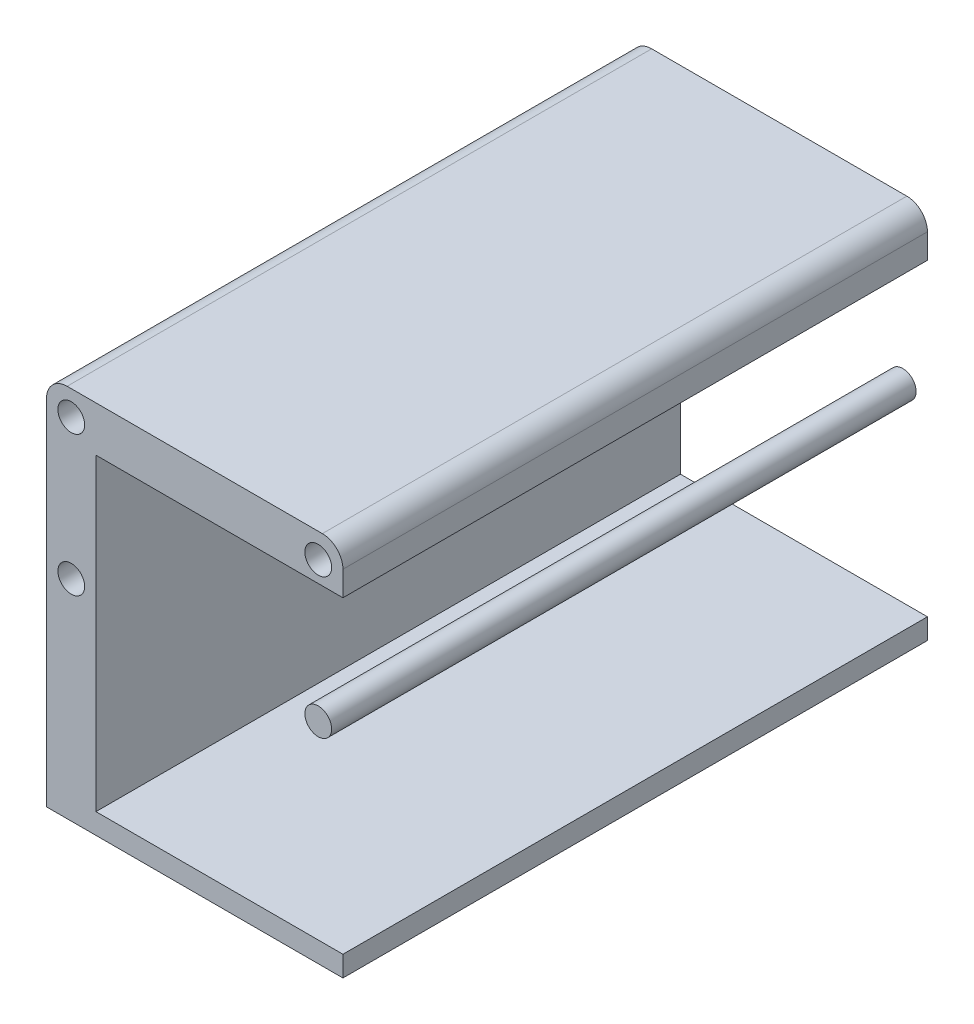
ISO-10303-21;
HEADER;
FILE_DESCRIPTION(('STEP AP214'),'2;1');
FILE_NAME('part.step','',(''),(''),'','','');
FILE_SCHEMA(('AUTOMOTIVE_DESIGN { 1 0 10303 214 1 1 1 1 }'));
ENDSEC;
DATA;
#1=APPLICATION_CONTEXT('core data for automotive mechanical design processes');
#2=APPLICATION_PROTOCOL_DEFINITION('international standard','automotive_design',2000,#1);
#3=PRODUCT_CONTEXT('',#1,'mechanical');
#4=PRODUCT('Part','Part','',(#3));
#5=PRODUCT_RELATED_PRODUCT_CATEGORY('part','',(#4));
#6=PRODUCT_DEFINITION_FORMATION('','',#4);
#7=PRODUCT_DEFINITION_CONTEXT('part definition',#1,'design');
#8=PRODUCT_DEFINITION('design','',#6,#7);
#9=PRODUCT_DEFINITION_SHAPE('','',#8);
#10=(LENGTH_UNIT() NAMED_UNIT(*) SI_UNIT(.MILLI.,.METRE.));
#11=(NAMED_UNIT(*) PLANE_ANGLE_UNIT() SI_UNIT($,.RADIAN.));
#12=(NAMED_UNIT(*) SI_UNIT($,.STERADIAN.) SOLID_ANGLE_UNIT());
#13=UNCERTAINTY_MEASURE_WITH_UNIT(LENGTH_MEASURE(1.E-05),#10,'distance_accuracy_value','');
#14=(GEOMETRIC_REPRESENTATION_CONTEXT(3) GLOBAL_UNCERTAINTY_ASSIGNED_CONTEXT((#13)) GLOBAL_UNIT_ASSIGNED_CONTEXT((#10,
#11,#12)) REPRESENTATION_CONTEXT('',''));
#15=CARTESIAN_POINT('',(0.,0.,0.));
#16=DIRECTION('',(0.,0.,1.));
#17=DIRECTION('',(1.,0.,0.));
#18=AXIS2_PLACEMENT_3D('',#15,#16,#17);
#19=CARTESIAN_POINT('',(30.0000000000002,51.0000000000004,147.));
#20=DIRECTION('',(0.,0.,-1.));
#21=DIRECTION('',(-1.,0.,0.));
#22=AXIS2_PLACEMENT_3D('',#19,#20,#21);
#23=CYLINDRICAL_SURFACE('',#22,3.25000000000001);
#24=CARTESIAN_POINT('',(30.0000000000002,51.0000000000004,147.));
#25=DIRECTION('',(0.,0.,1.));
#26=DIRECTION('',(1.,0.,0.));
#27=AXIS2_PLACEMENT_3D('',#24,#25,#26);
#28=CIRCLE('',#27,3.25000000000001);
#29=CARTESIAN_POINT('',(33.2500000000003,51.0000000000004,147.));
#30=VERTEX_POINT('',#29);
#31=EDGE_CURVE('E49',#30,#30,#28,.T.);
#32=ORIENTED_EDGE('',*,*,#31,.F.);
#33=EDGE_LOOP('',(#32));
#34=FACE_BOUND('',#33,.T.);
#35=CARTESIAN_POINT('',(30.0000000000002,51.0000000000004,5.));
#36=DIRECTION('',(0.,0.,1.));
#37=DIRECTION('',(1.,0.,0.));
#38=AXIS2_PLACEMENT_3D('',#35,#36,#37);
#39=CIRCLE('',#38,3.25000000000001);
#40=CARTESIAN_POINT('',(33.2500000000003,51.0000000000004,5.));
#41=VERTEX_POINT('',#40);
#42=EDGE_CURVE('E11',#41,#41,#39,.T.);
#43=ORIENTED_EDGE('',*,*,#42,.T.);
#44=EDGE_LOOP('',(#43));
#45=FACE_BOUND('',#44,.T.);
#46=ADVANCED_FACE('F45',(#34,#45),#23,.T.);
#47=CARTESIAN_POINT('',(30.0000000000002,51.0000000000004,147.));
#48=DIRECTION('',(0.,0.,1.));
#49=DIRECTION('',(1.,0.,0.));
#50=AXIS2_PLACEMENT_3D('',#47,#48,#49);
#51=PLANE('',#50);
#52=ORIENTED_EDGE('',*,*,#31,.T.);
#53=EDGE_LOOP('',(#52));
#54=FACE_BOUND('',#53,.T.);
#55=ADVANCED_FACE('F47',(#54),#51,.T.);
#56=CARTESIAN_POINT('',(30.0000000000002,51.0000000000004,5.));
#57=DIRECTION('',(0.,0.,1.));
#58=DIRECTION('',(1.,0.,0.));
#59=AXIS2_PLACEMENT_3D('',#56,#57,#58);
#60=PLANE('',#59);
#61=ORIENTED_EDGE('',*,*,#42,.F.);
#62=EDGE_LOOP('',(#61));
#63=FACE_BOUND('',#62,.T.);
#64=ADVANCED_FACE('F64',(#63),#60,.F.);
#65=CLOSED_SHELL('',(#46,#55,#64));
#66=MANIFOLD_SOLID_BREP('B2',#65);
#67=CARTESIAN_POINT('',(-31.0000000000002,85.9999999999999,147.));
#68=DIRECTION('',(0.,0.,1.));
#69=DIRECTION('',(1.,0.,0.));
#70=AXIS2_PLACEMENT_3D('',#67,#68,#69);
#71=PLANE('',#70);
#72=CARTESIAN_POINT('',(-30.0000000000002,51.0000000000004,147.));
#73=DIRECTION('',(0.,0.,1.));
#74=DIRECTION('',(1.,0.,0.));
#75=AXIS2_PLACEMENT_3D('',#72,#73,#74);
#76=CIRCLE('',#75,3.25000000000001);
#77=CARTESIAN_POINT('',(-26.7500000000002,51.0000000000004,147.));
#78=VERTEX_POINT('',#77);
#79=EDGE_CURVE('E271',#78,#78,#76,.T.);
#80=ORIENTED_EDGE('',*,*,#79,.F.);
#81=EDGE_LOOP('',(#80));
#82=FACE_BOUND('',#81,.T.);
#83=CARTESIAN_POINT('',(-31.0000000000002,85.9999999999999,147.));
#84=DIRECTION('',(0.,0.,1.));
#85=DIRECTION('',(1.,0.,0.));
#86=AXIS2_PLACEMENT_3D('',#83,#84,#85);
#87=CIRCLE('',#86,5.00000000000003);
#88=CARTESIAN_POINT('',(-31.0000000000002,91.,147.));
#89=VERTEX_POINT('',#88);
#90=CARTESIAN_POINT('',(-36.0000000000002,85.9999999999999,147.));
#91=VERTEX_POINT('',#90);
#92=EDGE_CURVE('E220',#89,#91,#87,.T.);
#93=ORIENTED_EDGE('',*,*,#92,.T.);
#94=DIRECTION('',(0.,-1.,0.));
#95=VECTOR('',#94,1.);
#96=CARTESIAN_POINT('',(-36.0000000000002,85.9999999999999,147.));
#97=LINE('',#96,#95);
#98=CARTESIAN_POINT('',(-36.0000000000002,0.,147.));
#99=VERTEX_POINT('',#98);
#100=EDGE_CURVE('E158',#91,#99,#97,.T.);
#101=ORIENTED_EDGE('',*,*,#100,.T.);
#102=DIRECTION('',(1.,0.,0.));
#103=VECTOR('',#102,1.);
#104=CARTESIAN_POINT('',(-36.0000000000002,0.,147.));
#105=LINE('',#104,#103);
#106=CARTESIAN_POINT('',(36.0000000000002,0.,147.));
#107=VERTEX_POINT('',#106);
#108=EDGE_CURVE('E241',#99,#107,#105,.T.);
#109=ORIENTED_EDGE('',*,*,#108,.T.);
#110=DIRECTION('',(0.,1.,0.));
#111=VECTOR('',#110,1.);
#112=CARTESIAN_POINT('',(36.0000000000002,5.00000000000001,147.));
#113=LINE('',#112,#111);
#114=CARTESIAN_POINT('',(36.0000000000002,5.00000000000001,147.));
#115=VERTEX_POINT('',#114);
#116=EDGE_CURVE('E260',#107,#115,#113,.T.);
#117=ORIENTED_EDGE('',*,*,#116,.T.);
#118=DIRECTION('',(-1.,0.,0.));
#119=VECTOR('',#118,1.);
#120=CARTESIAN_POINT('',(36.0000000000002,5.00000000000001,147.));
#121=LINE('',#120,#119);
#122=CARTESIAN_POINT('',(-24.,5.00000000000001,147.));
#123=VERTEX_POINT('',#122);
#124=EDGE_CURVE('E257',#115,#123,#121,.T.);
#125=ORIENTED_EDGE('',*,*,#124,.T.);
#126=DIRECTION('',(0.,1.,0.));
#127=VECTOR('',#126,1.);
#128=CARTESIAN_POINT('',(-24.,5.00000000000001,147.));
#129=LINE('',#128,#127);
#130=CARTESIAN_POINT('',(-24.,79.9999999999999,147.));
#131=VERTEX_POINT('',#130);
#132=EDGE_CURVE('E259',#123,#131,#129,.T.);
#133=ORIENTED_EDGE('',*,*,#132,.T.);
#134=DIRECTION('',(1.,0.,0.));
#135=VECTOR('',#134,1.);
#136=CARTESIAN_POINT('',(-24.,79.9999999999999,147.));
#137=LINE('',#136,#135);
#138=CARTESIAN_POINT('',(36.0000000000002,79.9999999999999,147.));
#139=VERTEX_POINT('',#138);
#140=EDGE_CURVE('E183',#131,#139,#137,.T.);
#141=ORIENTED_EDGE('',*,*,#140,.T.);
#142=DIRECTION('',(0.,1.,0.));
#143=VECTOR('',#142,1.);
#144=CARTESIAN_POINT('',(36.0000000000002,79.9999999999999,147.));
#145=LINE('',#144,#143);
#146=CARTESIAN_POINT('',(36.0000000000002,85.9999999999999,147.));
#147=VERTEX_POINT('',#146);
#148=EDGE_CURVE('E177',#139,#147,#145,.T.);
#149=ORIENTED_EDGE('',*,*,#148,.T.);
#150=CARTESIAN_POINT('',(31.0000000000002,85.9999999999999,147.));
#151=DIRECTION('',(0.,0.,1.));
#152=DIRECTION('',(1.,0.,0.));
#153=AXIS2_PLACEMENT_3D('',#150,#151,#152);
#154=CIRCLE('',#153,5.);
#155=CARTESIAN_POINT('',(31.0000000000002,90.9999999999999,147.));
#156=VERTEX_POINT('',#155);
#157=EDGE_CURVE('E181',#147,#156,#154,.T.);
#158=ORIENTED_EDGE('',*,*,#157,.T.);
#159=DIRECTION('',(-1.,0.,0.));
#160=VECTOR('',#159,1.);
#161=CARTESIAN_POINT('',(31.0000000000002,90.9999999999999,147.));
#162=LINE('',#161,#160);
#163=EDGE_CURVE('E109',#156,#89,#162,.T.);
#164=ORIENTED_EDGE('',*,*,#163,.T.);
#165=EDGE_LOOP('',(#93,#101,#109,#117,#125,#133,#141,#149,#158,#164));
#166=FACE_BOUND('',#165,.T.);
#167=CARTESIAN_POINT('',(30.0000000000002,85.0000000000004,147.));
#168=DIRECTION('',(0.,0.,1.));
#169=DIRECTION('',(1.,0.,0.));
#170=AXIS2_PLACEMENT_3D('',#167,#168,#169);
#171=CIRCLE('',#170,3.25);
#172=CARTESIAN_POINT('',(33.2500000000002,85.0000000000004,147.));
#173=VERTEX_POINT('',#172);
#174=EDGE_CURVE('E205',#173,#173,#171,.T.);
#175=ORIENTED_EDGE('',*,*,#174,.F.);
#176=EDGE_LOOP('',(#175));
#177=FACE_BOUND('',#176,.T.);
#178=CARTESIAN_POINT('',(-30.0000000000002,85.0000000000004,147.));
#179=DIRECTION('',(0.,0.,1.));
#180=DIRECTION('',(1.,0.,0.));
#181=AXIS2_PLACEMENT_3D('',#178,#179,#180);
#182=CIRCLE('',#181,3.25000000000001);
#183=CARTESIAN_POINT('',(-26.7500000000002,85.0000000000004,147.));
#184=VERTEX_POINT('',#183);
#185=EDGE_CURVE('E277',#184,#184,#182,.T.);
#186=ORIENTED_EDGE('',*,*,#185,.F.);
#187=EDGE_LOOP('',(#186));
#188=FACE_BOUND('',#187,.T.);
#189=ADVANCED_FACE('F92',(#82,#166,#177,#188),#71,.T.);
#190=CARTESIAN_POINT('',(-31.0000000000002,85.9999999999999,5.));
#191=DIRECTION('',(0.,0.,1.));
#192=DIRECTION('',(1.,0.,0.));
#193=AXIS2_PLACEMENT_3D('',#190,#191,#192);
#194=PLANE('',#193);
#195=CARTESIAN_POINT('',(-31.0000000000002,85.9999999999999,5.));
#196=DIRECTION('',(0.,0.,1.));
#197=DIRECTION('',(1.,0.,0.));
#198=AXIS2_PLACEMENT_3D('',#195,#196,#197);
#199=CIRCLE('',#198,5.00000000000003);
#200=CARTESIAN_POINT('',(-31.0000000000002,91.,5.));
#201=VERTEX_POINT('',#200);
#202=CARTESIAN_POINT('',(-36.0000000000002,85.9999999999999,5.));
#203=VERTEX_POINT('',#202);
#204=EDGE_CURVE('E201',#201,#203,#199,.T.);
#205=ORIENTED_EDGE('',*,*,#204,.F.);
#206=DIRECTION('',(-1.,0.,0.));
#207=VECTOR('',#206,1.);
#208=CARTESIAN_POINT('',(31.0000000000002,90.9999999999999,5.));
#209=LINE('',#208,#207);
#210=CARTESIAN_POINT('',(31.0000000000002,90.9999999999999,5.));
#211=VERTEX_POINT('',#210);
#212=EDGE_CURVE('E150',#211,#201,#209,.T.);
#213=ORIENTED_EDGE('',*,*,#212,.F.);
#214=CARTESIAN_POINT('',(31.0000000000002,85.9999999999999,5.));
#215=DIRECTION('',(0.,0.,1.));
#216=DIRECTION('',(1.,0.,0.));
#217=AXIS2_PLACEMENT_3D('',#214,#215,#216);
#218=CIRCLE('',#217,5.);
#219=CARTESIAN_POINT('',(36.0000000000002,85.9999999999999,5.));
#220=VERTEX_POINT('',#219);
#221=EDGE_CURVE('E144',#220,#211,#218,.T.);
#222=ORIENTED_EDGE('',*,*,#221,.F.);
#223=DIRECTION('',(0.,1.,0.));
#224=VECTOR('',#223,1.);
#225=CARTESIAN_POINT('',(36.0000000000002,79.9999999999999,5.));
#226=LINE('',#225,#224);
#227=CARTESIAN_POINT('',(36.0000000000002,79.9999999999999,5.));
#228=VERTEX_POINT('',#227);
#229=EDGE_CURVE('E191',#228,#220,#226,.T.);
#230=ORIENTED_EDGE('',*,*,#229,.F.);
#231=DIRECTION('',(1.,0.,0.));
#232=VECTOR('',#231,1.);
#233=CARTESIAN_POINT('',(-24.,79.9999999999999,5.));
#234=LINE('',#233,#232);
#235=CARTESIAN_POINT('',(-24.,79.9999999999999,5.));
#236=VERTEX_POINT('',#235);
#237=EDGE_CURVE('E215',#236,#228,#234,.T.);
#238=ORIENTED_EDGE('',*,*,#237,.F.);
#239=DIRECTION('',(0.,1.,0.));
#240=VECTOR('',#239,1.);
#241=CARTESIAN_POINT('',(-24.,5.00000000000001,5.));
#242=LINE('',#241,#240);
#243=CARTESIAN_POINT('',(-24.,5.00000000000001,5.));
#244=VERTEX_POINT('',#243);
#245=EDGE_CURVE('E213',#244,#236,#242,.T.);
#246=ORIENTED_EDGE('',*,*,#245,.F.);
#247=DIRECTION('',(-1.,0.,0.));
#248=VECTOR('',#247,1.);
#249=CARTESIAN_POINT('',(36.0000000000002,5.00000000000001,5.));
#250=LINE('',#249,#248);
#251=CARTESIAN_POINT('',(36.0000000000002,5.00000000000001,5.));
#252=VERTEX_POINT('',#251);
#253=EDGE_CURVE('E211',#252,#244,#250,.T.);
#254=ORIENTED_EDGE('',*,*,#253,.F.);
#255=DIRECTION('',(0.,1.,0.));
#256=VECTOR('',#255,1.);
#257=CARTESIAN_POINT('',(36.0000000000002,5.00000000000001,5.));
#258=LINE('',#257,#256);
#259=CARTESIAN_POINT('',(36.0000000000002,0.,5.));
#260=VERTEX_POINT('',#259);
#261=EDGE_CURVE('E209',#260,#252,#258,.T.);
#262=ORIENTED_EDGE('',*,*,#261,.F.);
#263=DIRECTION('',(1.,0.,0.));
#264=VECTOR('',#263,1.);
#265=CARTESIAN_POINT('',(-36.0000000000002,0.,5.));
#266=LINE('',#265,#264);
#267=CARTESIAN_POINT('',(-36.0000000000002,0.,5.));
#268=VERTEX_POINT('',#267);
#269=EDGE_CURVE('E207',#268,#260,#266,.T.);
#270=ORIENTED_EDGE('',*,*,#269,.F.);
#271=DIRECTION('',(0.,-1.,0.));
#272=VECTOR('',#271,1.);
#273=CARTESIAN_POINT('',(-36.0000000000002,85.9999999999999,5.));
#274=LINE('',#273,#272);
#275=EDGE_CURVE('E204',#203,#268,#274,.T.);
#276=ORIENTED_EDGE('',*,*,#275,.F.);
#277=EDGE_LOOP('',(#205,#213,#222,#230,#238,#246,#254,#262,#270,#276));
#278=FACE_BOUND('',#277,.T.);
#279=CARTESIAN_POINT('',(30.0000000000002,85.0000000000004,5.));
#280=DIRECTION('',(0.,0.,1.));
#281=DIRECTION('',(1.,0.,0.));
#282=AXIS2_PLACEMENT_3D('',#279,#280,#281);
#283=CIRCLE('',#282,3.25);
#284=CARTESIAN_POINT('',(33.2500000000002,85.0000000000004,5.));
#285=VERTEX_POINT('',#284);
#286=EDGE_CURVE('E268',#285,#285,#283,.T.);
#287=ORIENTED_EDGE('',*,*,#286,.T.);
#288=EDGE_LOOP('',(#287));
#289=FACE_BOUND('',#288,.T.);
#290=CARTESIAN_POINT('',(-30.0000000000002,51.0000000000004,5.));
#291=DIRECTION('',(0.,0.,1.));
#292=DIRECTION('',(1.,0.,0.));
#293=AXIS2_PLACEMENT_3D('',#290,#291,#292);
#294=CIRCLE('',#293,3.25000000000001);
#295=CARTESIAN_POINT('',(-26.7500000000002,51.0000000000004,5.));
#296=VERTEX_POINT('',#295);
#297=EDGE_CURVE('E274',#296,#296,#294,.T.);
#298=ORIENTED_EDGE('',*,*,#297,.T.);
#299=EDGE_LOOP('',(#298));
#300=FACE_BOUND('',#299,.T.);
#301=CARTESIAN_POINT('',(-30.0000000000002,85.0000000000004,5.));
#302=DIRECTION('',(0.,0.,1.));
#303=DIRECTION('',(1.,0.,0.));
#304=AXIS2_PLACEMENT_3D('',#301,#302,#303);
#305=CIRCLE('',#304,3.25000000000001);
#306=CARTESIAN_POINT('',(-26.7500000000002,85.0000000000004,5.));
#307=VERTEX_POINT('',#306);
#308=EDGE_CURVE('E280',#307,#307,#305,.T.);
#309=ORIENTED_EDGE('',*,*,#308,.T.);
#310=EDGE_LOOP('',(#309));
#311=FACE_BOUND('',#310,.T.);
#312=ADVANCED_FACE('F245',(#278,#289,#300,#311),#194,.F.);
#313=CARTESIAN_POINT('',(-31.0000000000002,85.9999999999999,147.));
#314=DIRECTION('',(0.,0.,-1.));
#315=DIRECTION('',(-1.,0.,0.));
#316=AXIS2_PLACEMENT_3D('',#313,#314,#315);
#317=CYLINDRICAL_SURFACE('',#316,5.00000000000003);
#318=ORIENTED_EDGE('',*,*,#204,.T.);
#319=DIRECTION('',(0.,0.,-1.));
#320=VECTOR('',#319,1.);
#321=CARTESIAN_POINT('',(-36.0000000000002,85.9999999999999,147.));
#322=LINE('',#321,#320);
#323=EDGE_CURVE('E43',#91,#203,#322,.T.);
#324=ORIENTED_EDGE('',*,*,#323,.F.);
#325=ORIENTED_EDGE('',*,*,#92,.F.);
#326=DIRECTION('',(0.,0.,-1.));
#327=VECTOR('',#326,1.);
#328=CARTESIAN_POINT('',(-31.0000000000002,91.,147.));
#329=LINE('',#328,#327);
#330=EDGE_CURVE('E197',#89,#201,#329,.T.);
#331=ORIENTED_EDGE('',*,*,#330,.T.);
#332=EDGE_LOOP('',(#318,#324,#325,#331));
#333=FACE_BOUND('',#332,.T.);
#334=ADVANCED_FACE('F94',(#333),#317,.T.);
#335=CARTESIAN_POINT('',(-36.0000000000002,85.9999999999999,147.));
#336=DIRECTION('',(1.,0.,0.));
#337=DIRECTION('',(0.,1.,0.));
#338=AXIS2_PLACEMENT_3D('',#335,#336,#337);
#339=PLANE('',#338);
#340=ORIENTED_EDGE('',*,*,#275,.T.);
#341=DIRECTION('',(0.,0.,-1.));
#342=VECTOR('',#341,1.);
#343=CARTESIAN_POINT('',(-36.0000000000002,0.,147.));
#344=LINE('',#343,#342);
#345=EDGE_CURVE('E101',#99,#268,#344,.T.);
#346=ORIENTED_EDGE('',*,*,#345,.F.);
#347=ORIENTED_EDGE('',*,*,#100,.F.);
#348=ORIENTED_EDGE('',*,*,#323,.T.);
#349=EDGE_LOOP('',(#340,#346,#347,#348));
#350=FACE_BOUND('',#349,.T.);
#351=ADVANCED_FACE('F321',(#350),#339,.F.);
#352=CARTESIAN_POINT('',(-36.0000000000002,0.,147.));
#353=DIRECTION('',(0.,1.,0.));
#354=DIRECTION('',(-1.,0.,0.));
#355=AXIS2_PLACEMENT_3D('',#352,#353,#354);
#356=PLANE('',#355);
#357=ORIENTED_EDGE('',*,*,#269,.T.);
#358=DIRECTION('',(0.,0.,-1.));
#359=VECTOR('',#358,1.);
#360=CARTESIAN_POINT('',(36.0000000000002,0.,147.));
#361=LINE('',#360,#359);
#362=EDGE_CURVE('E233',#107,#260,#361,.T.);
#363=ORIENTED_EDGE('',*,*,#362,.F.);
#364=ORIENTED_EDGE('',*,*,#108,.F.);
#365=ORIENTED_EDGE('',*,*,#345,.T.);
#366=EDGE_LOOP('',(#357,#363,#364,#365));
#367=FACE_BOUND('',#366,.T.);
#368=ADVANCED_FACE('F239',(#367),#356,.F.);
#369=CARTESIAN_POINT('',(36.0000000000002,5.00000000000001,147.));
#370=DIRECTION('',(-1.,0.,0.));
#371=DIRECTION('',(0.,-1.,0.));
#372=AXIS2_PLACEMENT_3D('',#369,#370,#371);
#373=PLANE('',#372);
#374=ORIENTED_EDGE('',*,*,#261,.T.);
#375=DIRECTION('',(0.,0.,-1.));
#376=VECTOR('',#375,1.);
#377=CARTESIAN_POINT('',(36.0000000000002,5.00000000000001,147.));
#378=LINE('',#377,#376);
#379=EDGE_CURVE('E230',#115,#252,#378,.T.);
#380=ORIENTED_EDGE('',*,*,#379,.F.);
#381=ORIENTED_EDGE('',*,*,#116,.F.);
#382=ORIENTED_EDGE('',*,*,#362,.T.);
#383=EDGE_LOOP('',(#374,#380,#381,#382));
#384=FACE_BOUND('',#383,.T.);
#385=ADVANCED_FACE('F251',(#384),#373,.F.);
#386=CARTESIAN_POINT('',(36.0000000000002,5.00000000000001,147.));
#387=DIRECTION('',(0.,-1.,0.));
#388=DIRECTION('',(1.,0.,0.));
#389=AXIS2_PLACEMENT_3D('',#386,#387,#388);
#390=PLANE('',#389);
#391=ORIENTED_EDGE('',*,*,#253,.T.);
#392=DIRECTION('',(0.,0.,-1.));
#393=VECTOR('',#392,1.);
#394=CARTESIAN_POINT('',(-24.,5.00000000000001,147.));
#395=LINE('',#394,#393);
#396=EDGE_CURVE('E227',#123,#244,#395,.T.);
#397=ORIENTED_EDGE('',*,*,#396,.F.);
#398=ORIENTED_EDGE('',*,*,#124,.F.);
#399=ORIENTED_EDGE('',*,*,#379,.T.);
#400=EDGE_LOOP('',(#391,#397,#398,#399));
#401=FACE_BOUND('',#400,.T.);
#402=ADVANCED_FACE('F255',(#401),#390,.F.);
#403=CARTESIAN_POINT('',(-24.,5.00000000000001,147.));
#404=DIRECTION('',(-1.,0.,0.));
#405=DIRECTION('',(0.,0.,1.));
#406=AXIS2_PLACEMENT_3D('',#403,#404,#405);
#407=PLANE('',#406);
#408=ORIENTED_EDGE('',*,*,#245,.T.);
#409=DIRECTION('',(0.,0.,-1.));
#410=VECTOR('',#409,1.);
#411=CARTESIAN_POINT('',(-24.,79.9999999999999,147.));
#412=LINE('',#411,#410);
#413=EDGE_CURVE('E224',#131,#236,#412,.T.);
#414=ORIENTED_EDGE('',*,*,#413,.F.);
#415=ORIENTED_EDGE('',*,*,#132,.F.);
#416=ORIENTED_EDGE('',*,*,#396,.T.);
#417=EDGE_LOOP('',(#408,#414,#415,#416));
#418=FACE_BOUND('',#417,.T.);
#419=ADVANCED_FACE('F311',(#418),#407,.F.);
#420=CARTESIAN_POINT('',(-24.,79.9999999999999,147.));
#421=DIRECTION('',(0.,1.,0.));
#422=DIRECTION('',(0.,0.,1.));
#423=AXIS2_PLACEMENT_3D('',#420,#421,#422);
#424=PLANE('',#423);
#425=ORIENTED_EDGE('',*,*,#237,.T.);
#426=DIRECTION('',(0.,0.,-1.));
#427=VECTOR('',#426,1.);
#428=CARTESIAN_POINT('',(36.0000000000002,79.9999999999999,147.));
#429=LINE('',#428,#427);
#430=EDGE_CURVE('E192',#139,#228,#429,.T.);
#431=ORIENTED_EDGE('',*,*,#430,.F.);
#432=ORIENTED_EDGE('',*,*,#140,.F.);
#433=ORIENTED_EDGE('',*,*,#413,.T.);
#434=EDGE_LOOP('',(#425,#431,#432,#433));
#435=FACE_BOUND('',#434,.T.);
#436=ADVANCED_FACE('F308',(#435),#424,.F.);
#437=CARTESIAN_POINT('',(36.0000000000002,79.9999999999999,147.));
#438=DIRECTION('',(-1.,0.,0.));
#439=DIRECTION('',(0.,-1.,0.));
#440=AXIS2_PLACEMENT_3D('',#437,#438,#439);
#441=PLANE('',#440);
#442=ORIENTED_EDGE('',*,*,#229,.T.);
#443=DIRECTION('',(0.,0.,-1.));
#444=VECTOR('',#443,1.);
#445=CARTESIAN_POINT('',(36.0000000000002,85.9999999999999,147.));
#446=LINE('',#445,#444);
#447=EDGE_CURVE('E188',#147,#220,#446,.T.);
#448=ORIENTED_EDGE('',*,*,#447,.F.);
#449=ORIENTED_EDGE('',*,*,#148,.F.);
#450=ORIENTED_EDGE('',*,*,#430,.T.);
#451=EDGE_LOOP('',(#442,#448,#449,#450));
#452=FACE_BOUND('',#451,.T.);
#453=ADVANCED_FACE('F189',(#452),#441,.F.);
#454=CARTESIAN_POINT('',(31.0000000000002,85.9999999999999,147.));
#455=DIRECTION('',(0.,0.,-1.));
#456=DIRECTION('',(-1.,0.,0.));
#457=AXIS2_PLACEMENT_3D('',#454,#455,#456);
#458=CYLINDRICAL_SURFACE('',#457,5.);
#459=ORIENTED_EDGE('',*,*,#221,.T.);
#460=DIRECTION('',(0.,0.,-1.));
#461=VECTOR('',#460,1.);
#462=CARTESIAN_POINT('',(31.0000000000002,90.9999999999999,147.));
#463=LINE('',#462,#461);
#464=EDGE_CURVE('E193',#156,#211,#463,.T.);
#465=ORIENTED_EDGE('',*,*,#464,.F.);
#466=ORIENTED_EDGE('',*,*,#157,.F.);
#467=ORIENTED_EDGE('',*,*,#447,.T.);
#468=EDGE_LOOP('',(#459,#465,#466,#467));
#469=FACE_BOUND('',#468,.T.);
#470=ADVANCED_FACE('F195',(#469),#458,.T.);
#471=CARTESIAN_POINT('',(31.0000000000002,90.9999999999999,147.));
#472=DIRECTION('',(0.,-1.,0.));
#473=DIRECTION('',(1.,0.,0.));
#474=AXIS2_PLACEMENT_3D('',#471,#472,#473);
#475=PLANE('',#474);
#476=ORIENTED_EDGE('',*,*,#212,.T.);
#477=ORIENTED_EDGE('',*,*,#330,.F.);
#478=ORIENTED_EDGE('',*,*,#163,.F.);
#479=ORIENTED_EDGE('',*,*,#464,.T.);
#480=EDGE_LOOP('',(#476,#477,#478,#479));
#481=FACE_BOUND('',#480,.T.);
#482=ADVANCED_FACE('F301',(#481),#475,.F.);
#483=CARTESIAN_POINT('',(30.0000000000002,85.0000000000004,147.));
#484=DIRECTION('',(0.,0.,-1.));
#485=DIRECTION('',(-1.,0.,0.));
#486=AXIS2_PLACEMENT_3D('',#483,#484,#485);
#487=CYLINDRICAL_SURFACE('',#486,3.25);
#488=ORIENTED_EDGE('',*,*,#174,.T.);
#489=EDGE_LOOP('',(#488));
#490=FACE_BOUND('',#489,.T.);
#491=ORIENTED_EDGE('',*,*,#286,.F.);
#492=EDGE_LOOP('',(#491));
#493=FACE_BOUND('',#492,.T.);
#494=ADVANCED_FACE('F298',(#490,#493),#487,.F.);
#495=CARTESIAN_POINT('',(-30.0000000000002,51.0000000000004,147.));
#496=DIRECTION('',(0.,0.,-1.));
#497=DIRECTION('',(-1.,0.,0.));
#498=AXIS2_PLACEMENT_3D('',#495,#496,#497);
#499=CYLINDRICAL_SURFACE('',#498,3.25000000000001);
#500=ORIENTED_EDGE('',*,*,#79,.T.);
#501=EDGE_LOOP('',(#500));
#502=FACE_BOUND('',#501,.T.);
#503=ORIENTED_EDGE('',*,*,#297,.F.);
#504=EDGE_LOOP('',(#503));
#505=FACE_BOUND('',#504,.T.);
#506=ADVANCED_FACE('F411',(#502,#505),#499,.F.);
#507=CARTESIAN_POINT('',(-30.0000000000002,85.0000000000004,147.));
#508=DIRECTION('',(0.,0.,-1.));
#509=DIRECTION('',(-1.,0.,0.));
#510=AXIS2_PLACEMENT_3D('',#507,#508,#509);
#511=CYLINDRICAL_SURFACE('',#510,3.25000000000001);
#512=ORIENTED_EDGE('',*,*,#185,.T.);
#513=EDGE_LOOP('',(#512));
#514=FACE_BOUND('',#513,.T.);
#515=ORIENTED_EDGE('',*,*,#308,.F.);
#516=EDGE_LOOP('',(#515));
#517=FACE_BOUND('',#516,.T.);
#518=ADVANCED_FACE('F286',(#514,#517),#511,.F.);
#519=CLOSED_SHELL('',(#189,#312,#334,#351,#368,#385,#402,#419,#436,#453,#470,#482,#494,#506,#518));
#520=MANIFOLD_SOLID_BREP('B6',#519);
#521=ADVANCED_BREP_SHAPE_REPRESENTATION('',(#18,#66,#520),#14);
#522=SHAPE_DEFINITION_REPRESENTATION(#9,#521);
ENDSEC;
END-ISO-10303-21;
